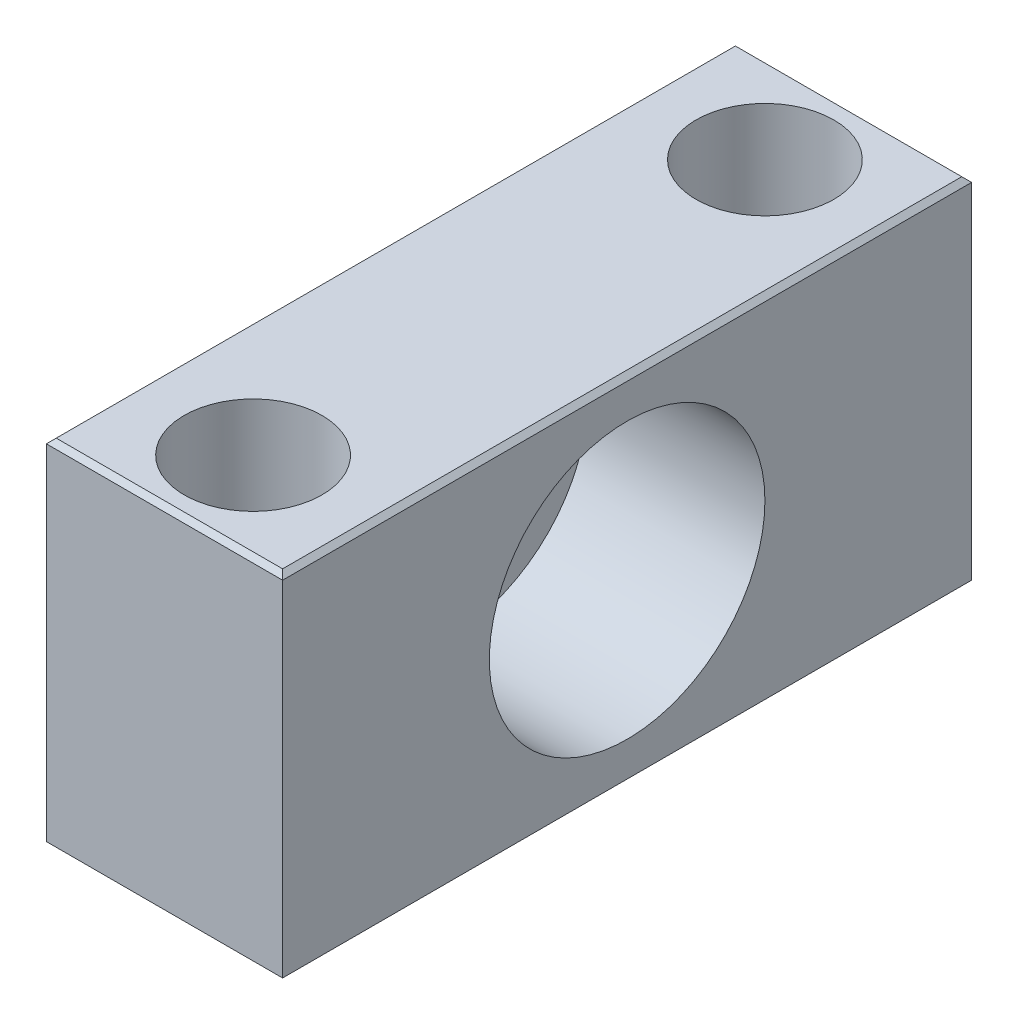
ISO-10303-21;
HEADER;
FILE_DESCRIPTION(('STEP AP214'),'2;1');
FILE_NAME('part.step','',(''),(''),'','','');
FILE_SCHEMA(('AUTOMOTIVE_DESIGN { 1 0 10303 214 1 1 1 1 }'));
ENDSEC;
DATA;
#1=APPLICATION_CONTEXT('core data for automotive mechanical design processes');
#2=APPLICATION_PROTOCOL_DEFINITION('international standard','automotive_design',2000,#1);
#3=PRODUCT_CONTEXT('',#1,'mechanical');
#4=PRODUCT('Part','Part','',(#3));
#5=PRODUCT_RELATED_PRODUCT_CATEGORY('part','',(#4));
#6=PRODUCT_DEFINITION_FORMATION('','',#4);
#7=PRODUCT_DEFINITION_CONTEXT('part definition',#1,'design');
#8=PRODUCT_DEFINITION('design','',#6,#7);
#9=PRODUCT_DEFINITION_SHAPE('','',#8);
#10=(LENGTH_UNIT() NAMED_UNIT(*) SI_UNIT(.MILLI.,.METRE.));
#11=(NAMED_UNIT(*) PLANE_ANGLE_UNIT() SI_UNIT($,.RADIAN.));
#12=(NAMED_UNIT(*) SI_UNIT($,.STERADIAN.) SOLID_ANGLE_UNIT());
#13=UNCERTAINTY_MEASURE_WITH_UNIT(LENGTH_MEASURE(1.E-05),#10,'distance_accuracy_value','');
#14=(GEOMETRIC_REPRESENTATION_CONTEXT(3) GLOBAL_UNCERTAINTY_ASSIGNED_CONTEXT((#13)) GLOBAL_UNIT_ASSIGNED_CONTEXT((#10,
#11,#12)) REPRESENTATION_CONTEXT('',''));
#15=CARTESIAN_POINT('',(0.,0.,0.));
#16=DIRECTION('',(0.,0.,1.));
#17=DIRECTION('',(1.,0.,0.));
#18=AXIS2_PLACEMENT_3D('',#15,#16,#17);
#19=CARTESIAN_POINT('',(17.75,-1.,26.));
#20=DIRECTION('',(0.,-1.,0.));
#21=DIRECTION('',(0.,0.,-1.));
#22=AXIS2_PLACEMENT_3D('',#19,#20,#21);
#23=PLANE('',#22);
#24=CARTESIAN_POINT('',(12.,-0.999999999999999,26.));
#25=DIRECTION('',(0.,-1.,0.));
#26=DIRECTION('',(0.,0.,-1.));
#27=AXIS2_PLACEMENT_3D('',#24,#25,#26);
#28=CIRCLE('',#27,4.5);
#29=CARTESIAN_POINT('',(12.,-0.999999999999999,21.5));
#30=VERTEX_POINT('',#29);
#31=EDGE_CURVE('E20',#30,#30,#28,.T.);
#32=ORIENTED_EDGE('',*,*,#31,.T.);
#33=EDGE_LOOP('',(#32));
#34=FACE_BOUND('',#33,.T.);
#35=CARTESIAN_POINT('',(12.,-1.,26.));
#36=DIRECTION('',(0.,-1.,0.));
#37=DIRECTION('',(0.,0.,-1.));
#38=AXIS2_PLACEMENT_3D('',#35,#36,#37);
#39=CIRCLE('',#38,7.);
#40=CARTESIAN_POINT('',(12.,-1.,19.));
#41=VERTEX_POINT('',#40);
#42=EDGE_CURVE('E148',#41,#41,#39,.F.);
#43=ORIENTED_EDGE('',*,*,#42,.T.);
#44=EDGE_LOOP('',(#43));
#45=FACE_BOUND('',#44,.T.);
#46=ADVANCED_FACE('F17',(#34,#45),#23,.F.);
#47=CARTESIAN_POINT('',(17.75,-1.,-26.));
#48=DIRECTION('',(0.,-1.,0.));
#49=DIRECTION('',(0.,0.,-1.));
#50=AXIS2_PLACEMENT_3D('',#47,#48,#49);
#51=PLANE('',#50);
#52=CARTESIAN_POINT('',(12.,-0.999999999999999,-26.));
#53=DIRECTION('',(0.,-1.,0.));
#54=DIRECTION('',(0.,0.,-1.));
#55=AXIS2_PLACEMENT_3D('',#52,#53,#54);
#56=CIRCLE('',#55,4.5);
#57=CARTESIAN_POINT('',(12.,-0.999999999999999,-30.5));
#58=VERTEX_POINT('',#57);
#59=EDGE_CURVE('E150',#58,#58,#56,.T.);
#60=ORIENTED_EDGE('',*,*,#59,.T.);
#61=EDGE_LOOP('',(#60));
#62=FACE_BOUND('',#61,.T.);
#63=CARTESIAN_POINT('',(12.,-1.,-26.));
#64=DIRECTION('',(0.,-1.,0.));
#65=DIRECTION('',(0.,0.,-1.));
#66=AXIS2_PLACEMENT_3D('',#63,#64,#65);
#67=CIRCLE('',#66,7.);
#68=CARTESIAN_POINT('',(12.,-1.,-33.));
#69=VERTEX_POINT('',#68);
#70=EDGE_CURVE('E145',#69,#69,#67,.F.);
#71=ORIENTED_EDGE('',*,*,#70,.T.);
#72=EDGE_LOOP('',(#71));
#73=FACE_BOUND('',#72,.T.);
#74=ADVANCED_FACE('F162',(#62,#73),#51,.F.);
#75=CARTESIAN_POINT('',(12.,-9.5,26.));
#76=DIRECTION('',(0.,-1.,0.));
#77=DIRECTION('',(0.,0.,-1.));
#78=AXIS2_PLACEMENT_3D('',#75,#76,#77);
#79=CYLINDRICAL_SURFACE('',#78,4.5);
#80=CARTESIAN_POINT('',(12.,-18.,26.));
#81=DIRECTION('',(0.,-1.,0.));
#82=DIRECTION('',(0.,0.,-1.));
#83=AXIS2_PLACEMENT_3D('',#80,#81,#82);
#84=CIRCLE('',#83,4.5);
#85=CARTESIAN_POINT('',(12.,-18.,21.5));
#86=VERTEX_POINT('',#85);
#87=EDGE_CURVE('E94',#86,#86,#84,.F.);
#88=ORIENTED_EDGE('',*,*,#87,.F.);
#89=EDGE_LOOP('',(#88));
#90=FACE_BOUND('',#89,.T.);
#91=ORIENTED_EDGE('',*,*,#31,.F.);
#92=EDGE_LOOP('',(#91));
#93=FACE_BOUND('',#92,.T.);
#94=ADVANCED_FACE('F159',(#90,#93),#79,.F.);
#95=CARTESIAN_POINT('',(12.,-9.5,-26.));
#96=DIRECTION('',(0.,-1.,0.));
#97=DIRECTION('',(0.,0.,-1.));
#98=AXIS2_PLACEMENT_3D('',#95,#96,#97);
#99=CYLINDRICAL_SURFACE('',#98,4.5);
#100=CARTESIAN_POINT('',(12.,-18.,-26.));
#101=DIRECTION('',(0.,-1.,0.));
#102=DIRECTION('',(0.,0.,-1.));
#103=AXIS2_PLACEMENT_3D('',#100,#101,#102);
#104=CIRCLE('',#103,4.5);
#105=CARTESIAN_POINT('',(12.,-18.,-30.5));
#106=VERTEX_POINT('',#105);
#107=EDGE_CURVE('E107',#106,#106,#104,.F.);
#108=ORIENTED_EDGE('',*,*,#107,.F.);
#109=EDGE_LOOP('',(#108));
#110=FACE_BOUND('',#109,.T.);
#111=ORIENTED_EDGE('',*,*,#59,.F.);
#112=EDGE_LOOP('',(#111));
#113=FACE_BOUND('',#112,.T.);
#114=ADVANCED_FACE('F161',(#110,#113),#99,.F.);
#115=CARTESIAN_POINT('',(15.,0.,0.));
#116=DIRECTION('',(1.,0.,0.));
#117=DIRECTION('',(0.,0.,-1.));
#118=AXIS2_PLACEMENT_3D('',#115,#116,#117);
#119=CYLINDRICAL_SURFACE('',#118,14.);
#120=CARTESIAN_POINT('',(24.,0.,0.));
#121=DIRECTION('',(1.,0.,0.));
#122=DIRECTION('',(0.,0.,-1.));
#123=AXIS2_PLACEMENT_3D('',#120,#121,#122);
#124=CIRCLE('',#123,14.);
#125=CARTESIAN_POINT('',(24.,0.,-14.));
#126=VERTEX_POINT('',#125);
#127=EDGE_CURVE('E137',#126,#126,#124,.F.);
#128=ORIENTED_EDGE('',*,*,#127,.F.);
#129=EDGE_LOOP('',(#128));
#130=FACE_BOUND('',#129,.T.);
#131=CARTESIAN_POINT('',(6.,0.,0.));
#132=DIRECTION('',(1.,0.,0.));
#133=DIRECTION('',(0.,0.,-1.));
#134=AXIS2_PLACEMENT_3D('',#131,#132,#133);
#135=CIRCLE('',#134,14.);
#136=CARTESIAN_POINT('',(6.,0.,-14.));
#137=VERTEX_POINT('',#136);
#138=EDGE_CURVE('E118',#137,#137,#135,.F.);
#139=ORIENTED_EDGE('',*,*,#138,.T.);
#140=EDGE_LOOP('',(#139));
#141=FACE_BOUND('',#140,.T.);
#142=ADVANCED_FACE('F170',(#130,#141),#119,.F.);
#143=CARTESIAN_POINT('',(23.5,-18.,35.));
#144=DIRECTION('',(0.707106781186548,-0.707106781186548,0.));
#145=DIRECTION('',(0.707106781186548,0.707106781186548,0.));
#146=AXIS2_PLACEMENT_3D('',#143,#144,#145);
#147=PLANE('',#146);
#148=DIRECTION('',(-0.577350269189626,-0.577350269189626,-0.577350269189626));
#149=VECTOR('',#148,1.);
#150=CARTESIAN_POINT('',(24.,-17.5,35.));
#151=LINE('',#150,#149);
#152=CARTESIAN_POINT('',(24.,-17.5,35.));
#153=VERTEX_POINT('',#152);
#154=CARTESIAN_POINT('',(23.5,-18.,34.5));
#155=VERTEX_POINT('',#154);
#156=EDGE_CURVE('E99',#153,#155,#151,.T.);
#157=ORIENTED_EDGE('',*,*,#156,.T.);
#158=DIRECTION('',(0.,0.,-1.));
#159=VECTOR('',#158,1.);
#160=CARTESIAN_POINT('',(23.5,-18.,35.));
#161=LINE('',#160,#159);
#162=CARTESIAN_POINT('',(23.5,-18.,-34.5));
#163=VERTEX_POINT('',#162);
#164=EDGE_CURVE('E79',#163,#155,#161,.F.);
#165=ORIENTED_EDGE('',*,*,#164,.F.);
#166=DIRECTION('',(0.577350269189626,0.577350269189626,-0.577350269189626));
#167=VECTOR('',#166,1.);
#168=CARTESIAN_POINT('',(23.5,-18.,-34.5));
#169=LINE('',#168,#167);
#170=CARTESIAN_POINT('',(24.,-17.5,-35.));
#171=VERTEX_POINT('',#170);
#172=EDGE_CURVE('E85',#163,#171,#169,.T.);
#173=ORIENTED_EDGE('',*,*,#172,.T.);
#174=DIRECTION('',(0.,0.,-1.));
#175=VECTOR('',#174,1.);
#176=CARTESIAN_POINT('',(24.,-17.5,35.));
#177=LINE('',#176,#175);
#178=EDGE_CURVE('E488',#153,#171,#177,.T.);
#179=ORIENTED_EDGE('',*,*,#178,.F.);
#180=EDGE_LOOP('',(#157,#165,#173,#179));
#181=FACE_BOUND('',#180,.T.);
#182=ADVANCED_FACE('F97',(#181),#147,.T.);
#183=CARTESIAN_POINT('',(12.,8.5,26.));
#184=DIRECTION('',(0.,-1.,0.));
#185=DIRECTION('',(0.,0.,-1.));
#186=AXIS2_PLACEMENT_3D('',#183,#184,#185);
#187=CYLINDRICAL_SURFACE('',#186,7.);
#188=CARTESIAN_POINT('',(12.,18.,26.));
#189=DIRECTION('',(0.,-1.,0.));
#190=DIRECTION('',(0.,0.,-1.));
#191=AXIS2_PLACEMENT_3D('',#188,#189,#190);
#192=CIRCLE('',#191,7.);
#193=CARTESIAN_POINT('',(12.,18.,19.));
#194=VERTEX_POINT('',#193);
#195=EDGE_CURVE('E133',#194,#194,#192,.T.);
#196=ORIENTED_EDGE('',*,*,#195,.F.);
#197=EDGE_LOOP('',(#196));
#198=FACE_BOUND('',#197,.T.);
#199=ORIENTED_EDGE('',*,*,#42,.F.);
#200=EDGE_LOOP('',(#199));
#201=FACE_BOUND('',#200,.T.);
#202=ADVANCED_FACE('F237',(#198,#201),#187,.F.);
#203=CARTESIAN_POINT('',(12.,8.5,-26.));
#204=DIRECTION('',(0.,-1.,0.));
#205=DIRECTION('',(0.,0.,-1.));
#206=AXIS2_PLACEMENT_3D('',#203,#204,#205);
#207=CYLINDRICAL_SURFACE('',#206,7.);
#208=CARTESIAN_POINT('',(12.,18.,-26.));
#209=DIRECTION('',(0.,-1.,0.));
#210=DIRECTION('',(0.,0.,-1.));
#211=AXIS2_PLACEMENT_3D('',#208,#209,#210);
#212=CIRCLE('',#211,7.);
#213=CARTESIAN_POINT('',(12.,18.,-33.));
#214=VERTEX_POINT('',#213);
#215=EDGE_CURVE('E129',#214,#214,#212,.T.);
#216=ORIENTED_EDGE('',*,*,#215,.F.);
#217=EDGE_LOOP('',(#216));
#218=FACE_BOUND('',#217,.T.);
#219=ORIENTED_EDGE('',*,*,#70,.F.);
#220=EDGE_LOOP('',(#219));
#221=FACE_BOUND('',#220,.T.);
#222=ADVANCED_FACE('F233',(#218,#221),#207,.F.);
#223=CARTESIAN_POINT('',(24.,17.5,35.));
#224=DIRECTION('',(0.707106781186548,0.707106781186548,0.));
#225=DIRECTION('',(-0.707106781186548,0.707106781186548,0.));
#226=AXIS2_PLACEMENT_3D('',#223,#224,#225);
#227=PLANE('',#226);
#228=DIRECTION('',(0.577350269189626,-0.577350269189626,0.577350269189626));
#229=VECTOR('',#228,1.);
#230=CARTESIAN_POINT('',(23.5,18.,34.5));
#231=LINE('',#230,#229);
#232=CARTESIAN_POINT('',(23.5,18.,34.5));
#233=VERTEX_POINT('',#232);
#234=CARTESIAN_POINT('',(24.,17.5,35.));
#235=VERTEX_POINT('',#234);
#236=EDGE_CURVE('E136',#233,#235,#231,.T.);
#237=ORIENTED_EDGE('',*,*,#236,.T.);
#238=DIRECTION('',(0.,0.,-1.));
#239=VECTOR('',#238,1.);
#240=CARTESIAN_POINT('',(24.,17.5,35.));
#241=LINE('',#240,#239);
#242=CARTESIAN_POINT('',(24.,17.5,-35.));
#243=VERTEX_POINT('',#242);
#244=EDGE_CURVE('E139',#243,#235,#241,.F.);
#245=ORIENTED_EDGE('',*,*,#244,.F.);
#246=DIRECTION('',(-0.577350269189626,0.577350269189626,0.577350269189626));
#247=VECTOR('',#246,1.);
#248=CARTESIAN_POINT('',(24.,17.5,-35.));
#249=LINE('',#248,#247);
#250=CARTESIAN_POINT('',(23.5,18.,-34.5));
#251=VERTEX_POINT('',#250);
#252=EDGE_CURVE('E114',#243,#251,#249,.T.);
#253=ORIENTED_EDGE('',*,*,#252,.T.);
#254=DIRECTION('',(0.,0.,1.));
#255=VECTOR('',#254,1.);
#256=CARTESIAN_POINT('',(23.5,18.,35.));
#257=LINE('',#256,#255);
#258=EDGE_CURVE('E128',#233,#251,#257,.F.);
#259=ORIENTED_EDGE('',*,*,#258,.F.);
#260=EDGE_LOOP('',(#237,#245,#253,#259));
#261=FACE_BOUND('',#260,.T.);
#262=ADVANCED_FACE('F229',(#261),#227,.T.);
#263=CARTESIAN_POINT('',(6.,10.75,0.));
#264=DIRECTION('',(-1.,0.,0.));
#265=DIRECTION('',(0.,0.,1.));
#266=AXIS2_PLACEMENT_3D('',#263,#264,#265);
#267=PLANE('',#266);
#268=ORIENTED_EDGE('',*,*,#138,.F.);
#269=EDGE_LOOP('',(#268));
#270=FACE_BOUND('',#269,.T.);
#271=CARTESIAN_POINT('',(6.,0.,0.));
#272=DIRECTION('',(1.,0.,0.));
#273=DIRECTION('',(0.,0.,-1.));
#274=AXIS2_PLACEMENT_3D('',#271,#272,#273);
#275=CIRCLE('',#274,7.5);
#276=CARTESIAN_POINT('',(6.,0.,-7.5));
#277=VERTEX_POINT('',#276);
#278=EDGE_CURVE('E124',#277,#277,#275,.F.);
#279=ORIENTED_EDGE('',*,*,#278,.T.);
#280=EDGE_LOOP('',(#279));
#281=FACE_BOUND('',#280,.T.);
#282=ADVANCED_FACE('F225',(#270,#281),#267,.F.);
#283=CARTESIAN_POINT('',(36.,18.,-34.5));
#284=DIRECTION('',(0.,-0.707106781186548,0.707106781186548));
#285=DIRECTION('',(0.,-0.707106781186548,-0.707106781186548));
#286=AXIS2_PLACEMENT_3D('',#283,#284,#285);
#287=PLANE('',#286);
#288=DIRECTION('',(1.,0.,0.));
#289=VECTOR('',#288,1.);
#290=CARTESIAN_POINT('',(0.,17.5,-35.));
#291=LINE('',#290,#289);
#292=CARTESIAN_POINT('',(0.,17.5,-35.));
#293=VERTEX_POINT('',#292);
#294=EDGE_CURVE('E504',#243,#293,#291,.F.);
#295=ORIENTED_EDGE('',*,*,#294,.T.);
#296=DIRECTION('',(-0.577350269189626,-0.577350269189626,-0.577350269189626));
#297=VECTOR('',#296,1.);
#298=CARTESIAN_POINT('',(0.499999999999987,18.,-34.5));
#299=LINE('',#298,#297);
#300=CARTESIAN_POINT('',(0.49999999999999,18.,-34.5));
#301=VERTEX_POINT('',#300);
#302=EDGE_CURVE('E116',#301,#293,#299,.T.);
#303=ORIENTED_EDGE('',*,*,#302,.F.);
#304=DIRECTION('',(1.,0.,0.));
#305=VECTOR('',#304,1.);
#306=CARTESIAN_POINT('',(23.5,18.,-34.5));
#307=LINE('',#306,#305);
#308=EDGE_CURVE('E132',#251,#301,#307,.F.);
#309=ORIENTED_EDGE('',*,*,#308,.F.);
#310=ORIENTED_EDGE('',*,*,#252,.F.);
#311=EDGE_LOOP('',(#295,#303,#309,#310));
#312=FACE_BOUND('',#311,.T.);
#313=ADVANCED_FACE('F222',(#312),#287,.F.);
#314=CARTESIAN_POINT('',(36.,-17.5,-35.));
#315=DIRECTION('',(0.,0.707106781186548,0.707106781186548));
#316=DIRECTION('',(0.,-0.707106781186548,0.707106781186548));
#317=AXIS2_PLACEMENT_3D('',#314,#315,#316);
#318=PLANE('',#317);
#319=DIRECTION('',(1.,0.,0.));
#320=VECTOR('',#319,1.);
#321=CARTESIAN_POINT('',(0.5,-18.,-34.5));
#322=LINE('',#321,#320);
#323=CARTESIAN_POINT('',(0.499999999999985,-18.,-34.5));
#324=VERTEX_POINT('',#323);
#325=EDGE_CURVE('E87',#324,#163,#322,.T.);
#326=ORIENTED_EDGE('',*,*,#325,.F.);
#327=DIRECTION('',(0.577350269189626,-0.577350269189626,0.577350269189626));
#328=VECTOR('',#327,1.);
#329=CARTESIAN_POINT('',(0.,-17.5,-35.));
#330=LINE('',#329,#328);
#331=CARTESIAN_POINT('',(0.,-17.5,-35.));
#332=VERTEX_POINT('',#331);
#333=EDGE_CURVE('E95',#332,#324,#330,.T.);
#334=ORIENTED_EDGE('',*,*,#333,.F.);
#335=DIRECTION('',(1.,0.,0.));
#336=VECTOR('',#335,1.);
#337=CARTESIAN_POINT('',(0.,-17.5,-35.));
#338=LINE('',#337,#336);
#339=EDGE_CURVE('E90',#332,#171,#338,.T.);
#340=ORIENTED_EDGE('',*,*,#339,.T.);
#341=ORIENTED_EDGE('',*,*,#172,.F.);
#342=EDGE_LOOP('',(#326,#334,#340,#341));
#343=FACE_BOUND('',#342,.T.);
#344=ADVANCED_FACE('F86',(#343),#318,.F.);
#345=CARTESIAN_POINT('',(0.5,-18.,35.));
#346=DIRECTION('',(0.,-1.,0.));
#347=DIRECTION('',(0.,0.,-1.));
#348=AXIS2_PLACEMENT_3D('',#345,#346,#347);
#349=PLANE('',#348);
#350=DIRECTION('',(1.,0.,0.));
#351=VECTOR('',#350,1.);
#352=CARTESIAN_POINT('',(36.,-18.,34.5));
#353=LINE('',#352,#351);
#354=CARTESIAN_POINT('',(0.499999999999991,-18.,34.5));
#355=VERTEX_POINT('',#354);
#356=EDGE_CURVE('E101',#155,#355,#353,.F.);
#357=ORIENTED_EDGE('',*,*,#356,.T.);
#358=DIRECTION('',(0.,0.,1.));
#359=VECTOR('',#358,1.);
#360=CARTESIAN_POINT('',(0.5,-18.,35.));
#361=LINE('',#360,#359);
#362=EDGE_CURVE('E106',#324,#355,#361,.T.);
#363=ORIENTED_EDGE('',*,*,#362,.F.);
#364=ORIENTED_EDGE('',*,*,#325,.T.);
#365=ORIENTED_EDGE('',*,*,#164,.T.);
#366=EDGE_LOOP('',(#357,#363,#364,#365));
#367=FACE_BOUND('',#366,.T.);
#368=ORIENTED_EDGE('',*,*,#107,.T.);
#369=EDGE_LOOP('',(#368));
#370=FACE_BOUND('',#369,.T.);
#371=ORIENTED_EDGE('',*,*,#87,.T.);
#372=EDGE_LOOP('',(#371));
#373=FACE_BOUND('',#372,.T.);
#374=ADVANCED_FACE('F103',(#367,#370,#373),#349,.T.);
#375=CARTESIAN_POINT('',(36.,-18.,34.5));
#376=DIRECTION('',(0.,0.707106781186548,-0.707106781186548));
#377=DIRECTION('',(0.,0.707106781186548,0.707106781186548));
#378=AXIS2_PLACEMENT_3D('',#375,#376,#377);
#379=PLANE('',#378);
#380=DIRECTION('',(1.,0.,0.));
#381=VECTOR('',#380,1.);
#382=CARTESIAN_POINT('',(0.,-17.5,35.));
#383=LINE('',#382,#381);
#384=CARTESIAN_POINT('',(0.,-17.5,35.));
#385=VERTEX_POINT('',#384);
#386=EDGE_CURVE('E494',#385,#153,#383,.T.);
#387=ORIENTED_EDGE('',*,*,#386,.F.);
#388=DIRECTION('',(-0.577350269189626,0.577350269189626,0.577350269189626));
#389=VECTOR('',#388,1.);
#390=CARTESIAN_POINT('',(0.5,-18.,34.5));
#391=LINE('',#390,#389);
#392=EDGE_CURVE('E500',#355,#385,#391,.T.);
#393=ORIENTED_EDGE('',*,*,#392,.F.);
#394=ORIENTED_EDGE('',*,*,#356,.F.);
#395=ORIENTED_EDGE('',*,*,#156,.F.);
#396=EDGE_LOOP('',(#387,#393,#394,#395));
#397=FACE_BOUND('',#396,.T.);
#398=ADVANCED_FACE('F213',(#397),#379,.F.);
#399=CARTESIAN_POINT('',(24.,-17.5,35.));
#400=DIRECTION('',(1.,0.,0.));
#401=DIRECTION('',(0.,0.,-1.));
#402=AXIS2_PLACEMENT_3D('',#399,#400,#401);
#403=PLANE('',#402);
#404=DIRECTION('',(0.,1.,0.));
#405=VECTOR('',#404,1.);
#406=CARTESIAN_POINT('',(24.,0.,35.));
#407=LINE('',#406,#405);
#408=EDGE_CURVE('E485',#153,#235,#407,.T.);
#409=ORIENTED_EDGE('',*,*,#408,.F.);
#410=ORIENTED_EDGE('',*,*,#178,.T.);
#411=DIRECTION('',(0.,1.,0.));
#412=VECTOR('',#411,1.);
#413=CARTESIAN_POINT('',(24.,0.,-35.));
#414=LINE('',#413,#412);
#415=EDGE_CURVE('E127',#171,#243,#414,.T.);
#416=ORIENTED_EDGE('',*,*,#415,.T.);
#417=ORIENTED_EDGE('',*,*,#244,.T.);
#418=EDGE_LOOP('',(#409,#410,#416,#417));
#419=FACE_BOUND('',#418,.T.);
#420=ORIENTED_EDGE('',*,*,#127,.T.);
#421=EDGE_LOOP('',(#420));
#422=FACE_BOUND('',#421,.T.);
#423=ADVANCED_FACE('F210',(#419,#422),#403,.T.);
#424=CARTESIAN_POINT('',(36.,17.5,35.));
#425=DIRECTION('',(0.,-0.707106781186548,-0.707106781186548));
#426=DIRECTION('',(0.,0.707106781186548,-0.707106781186548));
#427=AXIS2_PLACEMENT_3D('',#424,#425,#426);
#428=PLANE('',#427);
#429=DIRECTION('',(1.,0.,0.));
#430=VECTOR('',#429,1.);
#431=CARTESIAN_POINT('',(23.5,18.,34.5));
#432=LINE('',#431,#430);
#433=CARTESIAN_POINT('',(0.499999999999987,18.,34.5));
#434=VERTEX_POINT('',#433);
#435=EDGE_CURVE('E509',#434,#233,#432,.T.);
#436=ORIENTED_EDGE('',*,*,#435,.F.);
#437=DIRECTION('',(0.577350269189626,0.577350269189626,-0.577350269189626));
#438=VECTOR('',#437,1.);
#439=CARTESIAN_POINT('',(0.,17.5,35.));
#440=LINE('',#439,#438);
#441=CARTESIAN_POINT('',(0.,17.5,35.));
#442=VERTEX_POINT('',#441);
#443=EDGE_CURVE('E35',#442,#434,#440,.T.);
#444=ORIENTED_EDGE('',*,*,#443,.F.);
#445=DIRECTION('',(1.,0.,0.));
#446=VECTOR('',#445,1.);
#447=CARTESIAN_POINT('',(0.,17.5,35.));
#448=LINE('',#447,#446);
#449=EDGE_CURVE('E490',#235,#442,#448,.F.);
#450=ORIENTED_EDGE('',*,*,#449,.F.);
#451=ORIENTED_EDGE('',*,*,#236,.F.);
#452=EDGE_LOOP('',(#436,#444,#450,#451));
#453=FACE_BOUND('',#452,.T.);
#454=ADVANCED_FACE('F206',(#453),#428,.F.);
#455=CARTESIAN_POINT('',(23.5,18.,35.));
#456=DIRECTION('',(0.,1.,0.));
#457=DIRECTION('',(0.,0.,1.));
#458=AXIS2_PLACEMENT_3D('',#455,#456,#457);
#459=PLANE('',#458);
#460=ORIENTED_EDGE('',*,*,#435,.T.);
#461=ORIENTED_EDGE('',*,*,#258,.T.);
#462=ORIENTED_EDGE('',*,*,#308,.T.);
#463=DIRECTION('',(0.,0.,1.));
#464=VECTOR('',#463,1.);
#465=CARTESIAN_POINT('',(0.5,18.,35.));
#466=LINE('',#465,#464);
#467=EDGE_CURVE('E123',#434,#301,#466,.F.);
#468=ORIENTED_EDGE('',*,*,#467,.F.);
#469=EDGE_LOOP('',(#460,#461,#462,#468));
#470=FACE_BOUND('',#469,.T.);
#471=ORIENTED_EDGE('',*,*,#215,.T.);
#472=EDGE_LOOP('',(#471));
#473=FACE_BOUND('',#472,.T.);
#474=ORIENTED_EDGE('',*,*,#195,.T.);
#475=EDGE_LOOP('',(#474));
#476=FACE_BOUND('',#475,.T.);
#477=ADVANCED_FACE('F202',(#470,#473,#476),#459,.T.);
#478=CARTESIAN_POINT('',(3.,0.,0.));
#479=DIRECTION('',(1.,0.,0.));
#480=DIRECTION('',(0.,0.,-1.));
#481=AXIS2_PLACEMENT_3D('',#478,#479,#480);
#482=CYLINDRICAL_SURFACE('',#481,7.5);
#483=CARTESIAN_POINT('',(0.,0.,0.));
#484=DIRECTION('',(1.,0.,0.));
#485=DIRECTION('',(0.,0.,-1.));
#486=AXIS2_PLACEMENT_3D('',#483,#484,#485);
#487=CIRCLE('',#486,7.5);
#488=CARTESIAN_POINT('',(0.,0.,-7.5));
#489=VERTEX_POINT('',#488);
#490=EDGE_CURVE('E119',#489,#489,#487,.T.);
#491=ORIENTED_EDGE('',*,*,#490,.F.);
#492=EDGE_LOOP('',(#491));
#493=FACE_BOUND('',#492,.T.);
#494=ORIENTED_EDGE('',*,*,#278,.F.);
#495=EDGE_LOOP('',(#494));
#496=FACE_BOUND('',#495,.T.);
#497=ADVANCED_FACE('F198',(#493,#496),#482,.F.);
#498=CARTESIAN_POINT('',(0.,0.,-35.));
#499=DIRECTION('',(0.,0.,1.));
#500=DIRECTION('',(1.,0.,0.));
#501=AXIS2_PLACEMENT_3D('',#498,#499,#500);
#502=PLANE('',#501);
#503=DIRECTION('',(0.,1.,0.));
#504=VECTOR('',#503,1.);
#505=CARTESIAN_POINT('',(0.,17.5,-35.));
#506=LINE('',#505,#504);
#507=EDGE_CURVE('E122',#293,#332,#506,.F.);
#508=ORIENTED_EDGE('',*,*,#507,.F.);
#509=ORIENTED_EDGE('',*,*,#294,.F.);
#510=ORIENTED_EDGE('',*,*,#415,.F.);
#511=ORIENTED_EDGE('',*,*,#339,.F.);
#512=EDGE_LOOP('',(#508,#509,#510,#511));
#513=FACE_BOUND('',#512,.T.);
#514=ADVANCED_FACE('F194',(#513),#502,.F.);
#515=CARTESIAN_POINT('',(0.,-17.5,35.));
#516=DIRECTION('',(-0.707106781186548,-0.707106781186548,0.));
#517=DIRECTION('',(0.707106781186548,-0.707106781186548,0.));
#518=AXIS2_PLACEMENT_3D('',#515,#516,#517);
#519=PLANE('',#518);
#520=ORIENTED_EDGE('',*,*,#333,.T.);
#521=ORIENTED_EDGE('',*,*,#362,.T.);
#522=ORIENTED_EDGE('',*,*,#392,.T.);
#523=DIRECTION('',(0.,0.,1.));
#524=VECTOR('',#523,1.);
#525=CARTESIAN_POINT('',(0.,-17.5,35.));
#526=LINE('',#525,#524);
#527=EDGE_CURVE('E518',#332,#385,#526,.T.);
#528=ORIENTED_EDGE('',*,*,#527,.F.);
#529=EDGE_LOOP('',(#520,#521,#522,#528));
#530=FACE_BOUND('',#529,.T.);
#531=ADVANCED_FACE('F190',(#530),#519,.T.);
#532=CARTESIAN_POINT('',(0.,0.,35.));
#533=DIRECTION('',(0.,0.,1.));
#534=DIRECTION('',(1.,0.,0.));
#535=AXIS2_PLACEMENT_3D('',#532,#533,#534);
#536=PLANE('',#535);
#537=ORIENTED_EDGE('',*,*,#449,.T.);
#538=DIRECTION('',(0.,1.,0.));
#539=VECTOR('',#538,1.);
#540=CARTESIAN_POINT('',(0.,17.5,35.));
#541=LINE('',#540,#539);
#542=EDGE_CURVE('E26',#385,#442,#541,.T.);
#543=ORIENTED_EDGE('',*,*,#542,.F.);
#544=ORIENTED_EDGE('',*,*,#386,.T.);
#545=ORIENTED_EDGE('',*,*,#408,.T.);
#546=EDGE_LOOP('',(#537,#543,#544,#545));
#547=FACE_BOUND('',#546,.T.);
#548=ADVANCED_FACE('F182',(#547),#536,.T.);
#549=CARTESIAN_POINT('',(0.5,18.,35.));
#550=DIRECTION('',(-0.707106781186548,0.707106781186548,0.));
#551=DIRECTION('',(-0.707106781186548,-0.707106781186548,0.));
#552=AXIS2_PLACEMENT_3D('',#549,#550,#551);
#553=PLANE('',#552);
#554=ORIENTED_EDGE('',*,*,#302,.T.);
#555=DIRECTION('',(0.,0.,1.));
#556=VECTOR('',#555,1.);
#557=CARTESIAN_POINT('',(0.,17.5,35.));
#558=LINE('',#557,#556);
#559=EDGE_CURVE('E11',#442,#293,#558,.F.);
#560=ORIENTED_EDGE('',*,*,#559,.F.);
#561=ORIENTED_EDGE('',*,*,#443,.T.);
#562=ORIENTED_EDGE('',*,*,#467,.T.);
#563=EDGE_LOOP('',(#554,#560,#561,#562));
#564=FACE_BOUND('',#563,.T.);
#565=ADVANCED_FACE('F176',(#564),#553,.T.);
#566=CARTESIAN_POINT('',(0.,17.5,35.));
#567=DIRECTION('',(-1.,0.,0.));
#568=DIRECTION('',(0.,0.,1.));
#569=AXIS2_PLACEMENT_3D('',#566,#567,#568);
#570=PLANE('',#569);
#571=ORIENTED_EDGE('',*,*,#542,.T.);
#572=ORIENTED_EDGE('',*,*,#559,.T.);
#573=ORIENTED_EDGE('',*,*,#507,.T.);
#574=ORIENTED_EDGE('',*,*,#527,.T.);
#575=EDGE_LOOP('',(#571,#572,#573,#574));
#576=FACE_BOUND('',#575,.T.);
#577=ORIENTED_EDGE('',*,*,#490,.T.);
#578=EDGE_LOOP('',(#577));
#579=FACE_BOUND('',#578,.T.);
#580=ADVANCED_FACE('F174',(#576,#579),#570,.T.);
#581=CLOSED_SHELL('',(#46,#74,#94,#114,#142,#182,#202,#222,#262,#282,#313,#344,#374,#398,#423,
#454,#477,#497,#514,#531,#548,#565,#580));
#582=MANIFOLD_SOLID_BREP('B1',#581);
#583=ADVANCED_BREP_SHAPE_REPRESENTATION('',(#18,#582),#14);
#584=SHAPE_DEFINITION_REPRESENTATION(#9,#583);
ENDSEC;
END-ISO-10303-21;
